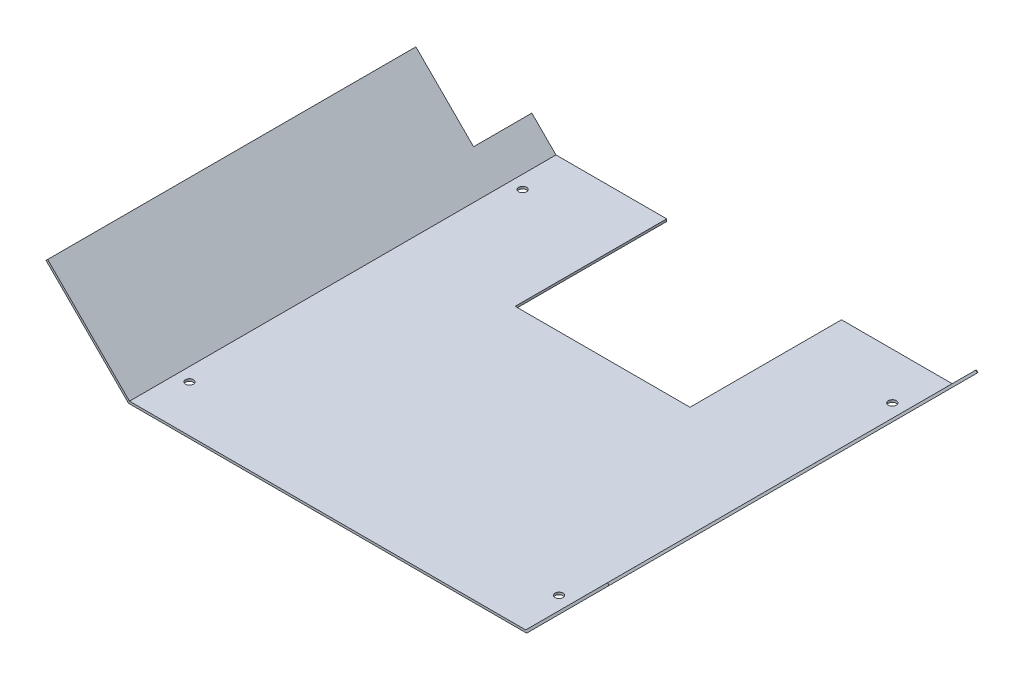
ISO-10303-21;
HEADER;
FILE_DESCRIPTION(('STEP AP214'),'2;1');
FILE_NAME('part.step','',(''),(''),'','','');
FILE_SCHEMA(('AUTOMOTIVE_DESIGN { 1 0 10303 214 1 1 1 1 }'));
ENDSEC;
DATA;
#1=APPLICATION_CONTEXT('core data for automotive mechanical design processes');
#2=APPLICATION_PROTOCOL_DEFINITION('international standard','automotive_design',2000,#1);
#3=PRODUCT_CONTEXT('',#1,'mechanical');
#4=PRODUCT('Part','Part','',(#3));
#5=PRODUCT_RELATED_PRODUCT_CATEGORY('part','',(#4));
#6=PRODUCT_DEFINITION_FORMATION('','',#4);
#7=PRODUCT_DEFINITION_CONTEXT('part definition',#1,'design');
#8=PRODUCT_DEFINITION('design','',#6,#7);
#9=PRODUCT_DEFINITION_SHAPE('','',#8);
#10=(LENGTH_UNIT() NAMED_UNIT(*) SI_UNIT(.MILLI.,.METRE.));
#11=(NAMED_UNIT(*) PLANE_ANGLE_UNIT() SI_UNIT($,.RADIAN.));
#12=(NAMED_UNIT(*) SI_UNIT($,.STERADIAN.) SOLID_ANGLE_UNIT());
#13=UNCERTAINTY_MEASURE_WITH_UNIT(LENGTH_MEASURE(1.E-05),#10,'distance_accuracy_value','');
#14=(GEOMETRIC_REPRESENTATION_CONTEXT(3) GLOBAL_UNCERTAINTY_ASSIGNED_CONTEXT((#13)) GLOBAL_UNIT_ASSIGNED_CONTEXT((#10,
#11,#12)) REPRESENTATION_CONTEXT('',''));
#15=CARTESIAN_POINT('',(0.,0.,0.));
#16=DIRECTION('',(0.,0.,1.));
#17=DIRECTION('',(1.,0.,0.));
#18=AXIS2_PLACEMENT_3D('',#15,#16,#17);
#19=CARTESIAN_POINT('',(181.763414842145,34.4059003953664,0.));
#20=DIRECTION('',(0.,0.,-1.));
#21=DIRECTION('',(-1.,0.,0.));
#22=AXIS2_PLACEMENT_3D('',#19,#20,#21);
#23=PLANE('',#22);
#24=DIRECTION('',(0.70709688415652,-0.707116678078053,0.));
#25=VECTOR('',#24,1.);
#26=CARTESIAN_POINT('',(35.8420481146136,130.83318444756,0.));
#27=LINE('',#26,#25);
#28=CARTESIAN_POINT('',(156.307234225257,10.3646261279663,0.));
#29=VERTEX_POINT('',#28);
#30=CARTESIAN_POINT('',(157.014331109414,9.65750944988825,0.));
#31=VERTEX_POINT('',#30);
#32=EDGE_CURVE('E158',#29,#31,#27,.T.);
#33=ORIENTED_EDGE('',*,*,#32,.T.);
#34=DIRECTION('',(0.707116678078054,0.70709688415652,0.));
#35=VECTOR('',#34,1.);
#36=CARTESIAN_POINT('',(146.649414842146,-0.707116678078054,0.));
#37=LINE('',#36,#35);
#38=CARTESIAN_POINT('',(146.356523321475,-1.,0.));
#39=VERTEX_POINT('',#38);
#40=EDGE_CURVE('E200',#39,#31,#37,.T.);
#41=ORIENTED_EDGE('',*,*,#40,.F.);
#42=DIRECTION('',(1.,0.,0.));
#43=VECTOR('',#42,1.);
#44=CARTESIAN_POINT('',(-24.057682042011,-1.,0.));
#45=LINE('',#44,#43);
#46=CARTESIAN_POINT('',(98.442317957989,-1.,0.));
#47=VERTEX_POINT('',#46);
#48=EDGE_CURVE('E188',#47,#39,#45,.T.);
#49=ORIENTED_EDGE('',*,*,#48,.F.);
#50=DIRECTION('',(0.,1.,0.));
#51=VECTOR('',#50,1.);
#52=CARTESIAN_POINT('',(98.442317957989,-1.,0.));
#53=LINE('',#52,#51);
#54=CARTESIAN_POINT('',(98.442317957989,0.,0.));
#55=VERTEX_POINT('',#54);
#56=EDGE_CURVE('E220',#47,#55,#53,.T.);
#57=ORIENTED_EDGE('',*,*,#56,.T.);
#58=DIRECTION('',(1.,0.,0.));
#59=VECTOR('',#58,1.);
#60=CARTESIAN_POINT('',(-24.057682042011,0.,0.));
#61=LINE('',#60,#59);
#62=CARTESIAN_POINT('',(145.942317957989,0.,0.));
#63=VERTEX_POINT('',#62);
#64=EDGE_CURVE('E196',#55,#63,#61,.T.);
#65=ORIENTED_EDGE('',*,*,#64,.T.);
#66=DIRECTION('',(0.707116678078054,0.70709688415652,0.));
#67=VECTOR('',#66,1.);
#68=CARTESIAN_POINT('',(145.942317957989,0.,0.));
#69=LINE('',#68,#67);
#70=EDGE_CURVE('E197',#63,#29,#69,.T.);
#71=ORIENTED_EDGE('',*,*,#70,.T.);
#72=EDGE_LOOP('',(#33,#41,#49,#57,#65,#71));
#73=FACE_BOUND('',#72,.T.);
#74=ADVANCED_FACE('F31',(#73),#23,.T.);
#75=CARTESIAN_POINT('',(146.649414842146,-0.707116678078054,183.));
#76=DIRECTION('',(-0.70709688415652,0.707116678078053,0.));
#77=DIRECTION('',(-0.707116678078054,-0.70709688415652,0.));
#78=AXIS2_PLACEMENT_3D('',#75,#76,#77);
#79=PLANE('',#78);
#80=ORIENTED_EDGE('',*,*,#40,.T.);
#81=DIRECTION('',(0.,0.,-1.));
#82=VECTOR('',#81,1.);
#83=CARTESIAN_POINT('',(157.014331109414,9.65750944988825,25.));
#84=LINE('',#83,#82);
#85=CARTESIAN_POINT('',(157.014331109414,9.65750944988825,25.));
#86=VERTEX_POINT('',#85);
#87=EDGE_CURVE('E290',#86,#31,#84,.T.);
#88=ORIENTED_EDGE('',*,*,#87,.F.);
#89=DIRECTION('',(-0.707116678078053,-0.70709688415652,0.));
#90=VECTOR('',#89,1.);
#91=CARTESIAN_POINT('',(157.014331109414,9.65750944988825,25.));
#92=LINE('',#91,#90);
#93=CARTESIAN_POINT('',(181.763414842145,34.4059003953664,25.));
#94=VERTEX_POINT('',#93);
#95=EDGE_CURVE('E286',#94,#86,#92,.T.);
#96=ORIENTED_EDGE('',*,*,#95,.F.);
#97=DIRECTION('',(0.,0.,-1.));
#98=VECTOR('',#97,1.);
#99=CARTESIAN_POINT('',(181.763414842145,34.4059003953664,183.));
#100=LINE('',#99,#98);
#101=CARTESIAN_POINT('',(181.763414842145,34.4059003953664,183.));
#102=VERTEX_POINT('',#101);
#103=EDGE_CURVE('E11',#102,#94,#100,.T.);
#104=ORIENTED_EDGE('',*,*,#103,.F.);
#105=DIRECTION('',(0.707116678078054,0.70709688415652,0.));
#106=VECTOR('',#105,1.);
#107=CARTESIAN_POINT('',(146.649414842146,-0.707116678078054,183.));
#108=LINE('',#107,#106);
#109=CARTESIAN_POINT('',(146.356523321475,-1.,183.));
#110=VERTEX_POINT('',#109);
#111=EDGE_CURVE('E187',#110,#102,#108,.T.);
#112=ORIENTED_EDGE('',*,*,#111,.F.);
#113=DIRECTION('',(0.,0.,-1.));
#114=VECTOR('',#113,1.);
#115=CARTESIAN_POINT('',(146.356523321475,-1.,183.));
#116=LINE('',#115,#114);
#117=EDGE_CURVE('E180',#110,#39,#116,.T.);
#118=ORIENTED_EDGE('',*,*,#117,.T.);
#119=EDGE_LOOP('',(#80,#88,#96,#104,#112,#118));
#120=FACE_BOUND('',#119,.T.);
#121=ADVANCED_FACE('F33',(#120),#79,.F.);
#122=CARTESIAN_POINT('',(181.056317957989,35.1130170734444,183.));
#123=DIRECTION('',(0.707116678078055,0.707096884156518,0.));
#124=DIRECTION('',(-0.707096884156518,0.707116678078055,0.));
#125=AXIS2_PLACEMENT_3D('',#122,#123,#124);
#126=PLANE('',#125);
#127=DIRECTION('',(0.70709688415652,-0.707116678078053,0.));
#128=VECTOR('',#127,1.);
#129=CARTESIAN_POINT('',(60.5911318473454,155.581575393038,25.));
#130=LINE('',#129,#128);
#131=CARTESIAN_POINT('',(181.056317957989,35.1130170734444,25.));
#132=VERTEX_POINT('',#131);
#133=EDGE_CURVE('E146',#132,#94,#130,.T.);
#134=ORIENTED_EDGE('',*,*,#133,.F.);
#135=DIRECTION('',(0.,0.,-1.));
#136=VECTOR('',#135,1.);
#137=CARTESIAN_POINT('',(181.056317957989,35.1130170734444,183.));
#138=LINE('',#137,#136);
#139=CARTESIAN_POINT('',(181.056317957989,35.1130170734444,183.));
#140=VERTEX_POINT('',#139);
#141=EDGE_CURVE('E39',#140,#132,#138,.T.);
#142=ORIENTED_EDGE('',*,*,#141,.F.);
#143=DIRECTION('',(0.707096884156518,-0.707116678078055,0.));
#144=VECTOR('',#143,1.);
#145=CARTESIAN_POINT('',(181.056317957989,35.1130170734444,183.));
#146=LINE('',#145,#144);
#147=EDGE_CURVE('E217',#140,#102,#146,.T.);
#148=ORIENTED_EDGE('',*,*,#147,.T.);
#149=ORIENTED_EDGE('',*,*,#103,.T.);
#150=EDGE_LOOP('',(#134,#142,#148,#149));
#151=FACE_BOUND('',#150,.T.);
#152=ADVANCED_FACE('F154',(#151),#126,.T.);
#153=CARTESIAN_POINT('',(145.942317957989,0.,183.));
#154=DIRECTION('',(-0.707096884156519,0.707116678078053,0.));
#155=DIRECTION('',(-0.707116678078054,-0.70709688415652,0.));
#156=AXIS2_PLACEMENT_3D('',#153,#154,#155);
#157=PLANE('',#156);
#158=DIRECTION('',(0.,0.,-1.));
#159=VECTOR('',#158,1.);
#160=CARTESIAN_POINT('',(156.307234225257,10.3646261279663,25.));
#161=LINE('',#160,#159);
#162=CARTESIAN_POINT('',(156.307234225257,10.3646261279663,25.));
#163=VERTEX_POINT('',#162);
#164=EDGE_CURVE('E151',#163,#29,#161,.T.);
#165=ORIENTED_EDGE('',*,*,#164,.T.);
#166=ORIENTED_EDGE('',*,*,#70,.F.);
#167=DIRECTION('',(0.,0.,-1.));
#168=VECTOR('',#167,1.);
#169=CARTESIAN_POINT('',(145.942317957989,0.,183.));
#170=LINE('',#169,#168);
#171=CARTESIAN_POINT('',(145.942317957989,0.,183.));
#172=VERTEX_POINT('',#171);
#173=EDGE_CURVE('E164',#172,#63,#170,.T.);
#174=ORIENTED_EDGE('',*,*,#173,.F.);
#175=DIRECTION('',(0.707116678078054,0.70709688415652,0.));
#176=VECTOR('',#175,1.);
#177=CARTESIAN_POINT('',(145.942317957989,0.,183.));
#178=LINE('',#177,#176);
#179=EDGE_CURVE('E163',#172,#140,#178,.T.);
#180=ORIENTED_EDGE('',*,*,#179,.T.);
#181=ORIENTED_EDGE('',*,*,#141,.T.);
#182=DIRECTION('',(-0.707116678078054,-0.70709688415652,0.));
#183=VECTOR('',#182,1.);
#184=CARTESIAN_POINT('',(156.307234225257,10.3646261279663,25.));
#185=LINE('',#184,#183);
#186=EDGE_CURVE('E143',#132,#163,#185,.T.);
#187=ORIENTED_EDGE('',*,*,#186,.T.);
#188=EDGE_LOOP('',(#165,#166,#174,#180,#181,#187));
#189=FACE_BOUND('',#188,.T.);
#190=ADVANCED_FACE('F161',(#189),#157,.T.);
#191=CARTESIAN_POINT('',(-24.057682042011,0.,183.));
#192=DIRECTION('',(0.,1.,0.));
#193=DIRECTION('',(0.,0.,1.));
#194=AXIS2_PLACEMENT_3D('',#191,#192,#193);
#195=PLANE('',#194);
#196=CARTESIAN_POINT('',(-18.357682042011,0.,20.));
#197=DIRECTION('',(0.,1.,0.));
#198=DIRECTION('',(0.,0.,1.));
#199=AXIS2_PLACEMENT_3D('',#196,#197,#198);
#200=CIRCLE('',#199,1.69999999999999);
#201=CARTESIAN_POINT('',(-18.357682042011,0.,21.7));
#202=VERTEX_POINT('',#201);
#203=EDGE_CURVE('E266',#202,#202,#200,.T.);
#204=ORIENTED_EDGE('',*,*,#203,.F.);
#205=EDGE_LOOP('',(#204));
#206=FACE_BOUND('',#205,.T.);
#207=CARTESIAN_POINT('',(140.242317957989,0.,20.));
#208=DIRECTION('',(0.,1.,0.));
#209=DIRECTION('',(0.,0.,1.));
#210=AXIS2_PLACEMENT_3D('',#207,#208,#209);
#211=CIRCLE('',#210,1.69999999999998);
#212=CARTESIAN_POINT('',(140.242317957989,0.,21.7));
#213=VERTEX_POINT('',#212);
#214=EDGE_CURVE('E260',#213,#213,#211,.T.);
#215=ORIENTED_EDGE('',*,*,#214,.F.);
#216=EDGE_LOOP('',(#215));
#217=FACE_BOUND('',#216,.T.);
#218=CARTESIAN_POINT('',(140.242317957989,0.,163.));
#219=DIRECTION('',(0.,1.,0.));
#220=DIRECTION('',(0.,0.,1.));
#221=AXIS2_PLACEMENT_3D('',#218,#219,#220);
#222=CIRCLE('',#221,1.69999999999998);
#223=CARTESIAN_POINT('',(140.242317957989,0.,164.7));
#224=VERTEX_POINT('',#223);
#225=EDGE_CURVE('E254',#224,#224,#222,.T.);
#226=ORIENTED_EDGE('',*,*,#225,.F.);
#227=EDGE_LOOP('',(#226));
#228=FACE_BOUND('',#227,.T.);
#229=CARTESIAN_POINT('',(-18.357682042011,0.,163.));
#230=DIRECTION('',(0.,1.,0.));
#231=DIRECTION('',(0.,0.,1.));
#232=AXIS2_PLACEMENT_3D('',#229,#230,#231);
#233=CIRCLE('',#232,1.69999999999999);
#234=CARTESIAN_POINT('',(-18.357682042011,0.,164.7));
#235=VERTEX_POINT('',#234);
#236=EDGE_CURVE('E248',#235,#235,#233,.T.);
#237=ORIENTED_EDGE('',*,*,#236,.F.);
#238=EDGE_LOOP('',(#237));
#239=FACE_BOUND('',#238,.T.);
#240=DIRECTION('',(0.,0.,-1.));
#241=VECTOR('',#240,1.);
#242=CARTESIAN_POINT('',(98.442317957989,0.,0.));
#243=LINE('',#242,#241);
#244=CARTESIAN_POINT('',(98.442317957989,0.,65.));
#245=VERTEX_POINT('',#244);
#246=EDGE_CURVE('E236',#245,#55,#243,.T.);
#247=ORIENTED_EDGE('',*,*,#246,.F.);
#248=DIRECTION('',(1.,0.,0.));
#249=VECTOR('',#248,1.);
#250=CARTESIAN_POINT('',(98.442317957989,0.,65.));
#251=LINE('',#250,#249);
#252=CARTESIAN_POINT('',(23.442317957989,0.,65.));
#253=VERTEX_POINT('',#252);
#254=EDGE_CURVE('E229',#253,#245,#251,.T.);
#255=ORIENTED_EDGE('',*,*,#254,.F.);
#256=DIRECTION('',(0.,0.,1.));
#257=VECTOR('',#256,1.);
#258=CARTESIAN_POINT('',(23.442317957989,0.,0.));
#259=LINE('',#258,#257);
#260=CARTESIAN_POINT('',(23.442317957989,0.,0.));
#261=VERTEX_POINT('',#260);
#262=EDGE_CURVE('E233',#261,#253,#259,.T.);
#263=ORIENTED_EDGE('',*,*,#262,.F.);
#264=CARTESIAN_POINT('',(-24.057682042011,0.,0.));
#265=VERTEX_POINT('',#264);
#266=EDGE_CURVE('E193',#265,#261,#61,.T.);
#267=ORIENTED_EDGE('',*,*,#266,.F.);
#268=DIRECTION('',(0.,0.,-1.));
#269=VECTOR('',#268,1.);
#270=CARTESIAN_POINT('',(-24.057682042011,0.,183.));
#271=LINE('',#270,#269);
#272=CARTESIAN_POINT('',(-24.057682042011,0.,183.));
#273=VERTEX_POINT('',#272);
#274=EDGE_CURVE('E166',#273,#265,#271,.T.);
#275=ORIENTED_EDGE('',*,*,#274,.F.);
#276=DIRECTION('',(1.,0.,0.));
#277=VECTOR('',#276,1.);
#278=CARTESIAN_POINT('',(-24.057682042011,0.,183.));
#279=LINE('',#278,#277);
#280=EDGE_CURVE('E213',#273,#172,#279,.T.);
#281=ORIENTED_EDGE('',*,*,#280,.T.);
#282=ORIENTED_EDGE('',*,*,#173,.T.);
#283=ORIENTED_EDGE('',*,*,#64,.F.);
#284=EDGE_LOOP('',(#247,#255,#263,#267,#275,#281,#282,#283));
#285=FACE_BOUND('',#284,.T.);
#286=ADVANCED_FACE('F300',(#206,#217,#228,#239,#285),#195,.T.);
#287=CARTESIAN_POINT('',(-59.1706991154554,35.114,183.));
#288=DIRECTION('',(0.707116678078054,0.707096884156519,0.));
#289=DIRECTION('',(-0.707096884156519,0.707116678078054,0.));
#290=AXIS2_PLACEMENT_3D('',#287,#288,#289);
#291=PLANE('',#290);
#292=DIRECTION('',(-0.707096884156519,0.707116678078054,0.));
#293=VECTOR('',#292,1.);
#294=CARTESIAN_POINT('',(-34.4223081699773,10.3649162672681,25.));
#295=LINE('',#294,#293);
#296=CARTESIAN_POINT('',(-34.4223081699773,10.3649162672681,25.));
#297=VERTEX_POINT('',#296);
#298=CARTESIAN_POINT('',(-59.1706991154554,35.114,25.));
#299=VERTEX_POINT('',#298);
#300=EDGE_CURVE('E282',#297,#299,#295,.T.);
#301=ORIENTED_EDGE('',*,*,#300,.T.);
#302=DIRECTION('',(0.,0.,-1.));
#303=VECTOR('',#302,1.);
#304=CARTESIAN_POINT('',(-59.1706991154554,35.114,183.));
#305=LINE('',#304,#303);
#306=CARTESIAN_POINT('',(-59.1706991154554,35.114,183.));
#307=VERTEX_POINT('',#306);
#308=EDGE_CURVE('E171',#307,#299,#305,.T.);
#309=ORIENTED_EDGE('',*,*,#308,.F.);
#310=DIRECTION('',(0.707096884156519,-0.707116678078054,0.));
#311=VECTOR('',#310,1.);
#312=CARTESIAN_POINT('',(-59.1706991154554,35.114,183.));
#313=LINE('',#312,#311);
#314=EDGE_CURVE('E210',#307,#273,#313,.T.);
#315=ORIENTED_EDGE('',*,*,#314,.T.);
#316=ORIENTED_EDGE('',*,*,#274,.T.);
#317=DIRECTION('',(0.707096884156519,-0.707116678078054,0.));
#318=VECTOR('',#317,1.);
#319=CARTESIAN_POINT('',(-59.1706991154554,35.114,0.));
#320=LINE('',#319,#318);
#321=CARTESIAN_POINT('',(-34.4223081699773,10.3649162672681,0.));
#322=VERTEX_POINT('',#321);
#323=EDGE_CURVE('E191',#322,#265,#320,.T.);
#324=ORIENTED_EDGE('',*,*,#323,.F.);
#325=DIRECTION('',(0.,0.,1.));
#326=VECTOR('',#325,1.);
#327=CARTESIAN_POINT('',(-34.4223081699773,10.3649162672681,0.));
#328=LINE('',#327,#326);
#329=EDGE_CURVE('E54',#322,#297,#328,.T.);
#330=ORIENTED_EDGE('',*,*,#329,.T.);
#331=EDGE_LOOP('',(#301,#309,#315,#316,#324,#330));
#332=FACE_BOUND('',#331,.T.);
#333=ADVANCED_FACE('F346',(#332),#291,.T.);
#334=CARTESIAN_POINT('',(-59.8778157935335,34.4069031158435,183.));
#335=DIRECTION('',(-0.707096884156518,0.707116678078055,0.));
#336=DIRECTION('',(-0.707116678078055,-0.707096884156518,0.));
#337=AXIS2_PLACEMENT_3D('',#334,#335,#336);
#338=PLANE('',#337);
#339=DIRECTION('',(-0.707116678078054,-0.707096884156519,0.));
#340=VECTOR('',#339,1.);
#341=CARTESIAN_POINT('',(61.300730091463,155.582056917605,25.));
#342=LINE('',#341,#340);
#343=CARTESIAN_POINT('',(-59.8778157935335,34.4069031158435,25.));
#344=VERTEX_POINT('',#343);
#345=EDGE_CURVE('E270',#299,#344,#342,.T.);
#346=ORIENTED_EDGE('',*,*,#345,.T.);
#347=DIRECTION('',(0.,0.,-1.));
#348=VECTOR('',#347,1.);
#349=CARTESIAN_POINT('',(-59.8778157935335,34.4069031158435,183.));
#350=LINE('',#349,#348);
#351=CARTESIAN_POINT('',(-59.8778157935335,34.4069031158435,183.));
#352=VERTEX_POINT('',#351);
#353=EDGE_CURVE('E174',#352,#344,#350,.T.);
#354=ORIENTED_EDGE('',*,*,#353,.F.);
#355=DIRECTION('',(0.707116678078055,0.707096884156518,0.));
#356=VECTOR('',#355,1.);
#357=CARTESIAN_POINT('',(-59.8778157935335,34.4069031158435,183.));
#358=LINE('',#357,#356);
#359=EDGE_CURVE('E207',#352,#307,#358,.T.);
#360=ORIENTED_EDGE('',*,*,#359,.T.);
#361=ORIENTED_EDGE('',*,*,#308,.T.);
#362=EDGE_LOOP('',(#346,#354,#360,#361));
#363=FACE_BOUND('',#362,.T.);
#364=ADVANCED_FACE('F361',(#363),#338,.T.);
#365=CARTESIAN_POINT('',(-59.8778157935335,34.4069031158435,183.));
#366=DIRECTION('',(0.707116678078054,0.707096884156519,0.));
#367=DIRECTION('',(-0.707096884156519,0.707116678078054,0.));
#368=AXIS2_PLACEMENT_3D('',#365,#366,#367);
#369=PLANE('',#368);
#370=ORIENTED_EDGE('',*,*,#353,.T.);
#371=DIRECTION('',(-0.707096884156519,0.707116678078054,0.));
#372=VECTOR('',#371,1.);
#373=CARTESIAN_POINT('',(-35.1294248480553,9.6578193831116,25.));
#374=LINE('',#373,#372);
#375=CARTESIAN_POINT('',(-35.1294248480553,9.6578193831116,25.));
#376=VERTEX_POINT('',#375);
#377=EDGE_CURVE('E274',#376,#344,#374,.T.);
#378=ORIENTED_EDGE('',*,*,#377,.F.);
#379=DIRECTION('',(0.,0.,1.));
#380=VECTOR('',#379,1.);
#381=CARTESIAN_POINT('',(-35.1294248480553,9.6578193831116,0.));
#382=LINE('',#381,#380);
#383=CARTESIAN_POINT('',(-35.1294248480553,9.6578193831116,0.));
#384=VERTEX_POINT('',#383);
#385=EDGE_CURVE('E279',#384,#376,#382,.T.);
#386=ORIENTED_EDGE('',*,*,#385,.F.);
#387=DIRECTION('',(0.707096884156519,-0.707116678078054,0.));
#388=VECTOR('',#387,1.);
#389=CARTESIAN_POINT('',(-59.8778157935335,34.4069031158435,0.));
#390=LINE('',#389,#388);
#391=CARTESIAN_POINT('',(-24.4719038033186,-1.,0.));
#392=VERTEX_POINT('',#391);
#393=EDGE_CURVE('E189',#384,#392,#390,.T.);
#394=ORIENTED_EDGE('',*,*,#393,.T.);
#395=DIRECTION('',(0.,0.,-1.));
#396=VECTOR('',#395,1.);
#397=CARTESIAN_POINT('',(-24.4719038033186,-1.,183.));
#398=LINE('',#397,#396);
#399=CARTESIAN_POINT('',(-24.4719038033186,-1.,183.));
#400=VERTEX_POINT('',#399);
#401=EDGE_CURVE('E177',#400,#392,#398,.T.);
#402=ORIENTED_EDGE('',*,*,#401,.F.);
#403=DIRECTION('',(0.707096884156519,-0.707116678078054,0.));
#404=VECTOR('',#403,1.);
#405=CARTESIAN_POINT('',(-59.8778157935335,34.4069031158435,183.));
#406=LINE('',#405,#404);
#407=EDGE_CURVE('E205',#352,#400,#406,.T.);
#408=ORIENTED_EDGE('',*,*,#407,.F.);
#409=EDGE_LOOP('',(#370,#378,#386,#394,#402,#408));
#410=FACE_BOUND('',#409,.T.);
#411=ADVANCED_FACE('F356',(#410),#369,.F.);
#412=CARTESIAN_POINT('',(-24.057682042011,-1.,183.));
#413=DIRECTION('',(0.,1.,0.));
#414=DIRECTION('',(0.,0.,1.));
#415=AXIS2_PLACEMENT_3D('',#412,#413,#414);
#416=PLANE('',#415);
#417=CARTESIAN_POINT('',(-18.357682042011,-1.,20.));
#418=DIRECTION('',(0.,1.,0.));
#419=DIRECTION('',(0.,0.,1.));
#420=AXIS2_PLACEMENT_3D('',#417,#418,#419);
#421=CIRCLE('',#420,1.7);
#422=CARTESIAN_POINT('',(-18.357682042011,-1.,21.7));
#423=VERTEX_POINT('',#422);
#424=EDGE_CURVE('E263',#423,#423,#421,.T.);
#425=ORIENTED_EDGE('',*,*,#424,.T.);
#426=EDGE_LOOP('',(#425));
#427=FACE_BOUND('',#426,.T.);
#428=CARTESIAN_POINT('',(140.242317957989,-1.,20.));
#429=DIRECTION('',(0.,1.,0.));
#430=DIRECTION('',(0.,0.,1.));
#431=AXIS2_PLACEMENT_3D('',#428,#429,#430);
#432=CIRCLE('',#431,1.70000000000001);
#433=CARTESIAN_POINT('',(140.242317957989,-1.,21.7));
#434=VERTEX_POINT('',#433);
#435=EDGE_CURVE('E257',#434,#434,#432,.T.);
#436=ORIENTED_EDGE('',*,*,#435,.T.);
#437=EDGE_LOOP('',(#436));
#438=FACE_BOUND('',#437,.T.);
#439=CARTESIAN_POINT('',(140.242317957989,-1.,163.));
#440=DIRECTION('',(0.,1.,0.));
#441=DIRECTION('',(0.,0.,1.));
#442=AXIS2_PLACEMENT_3D('',#439,#440,#441);
#443=CIRCLE('',#442,1.70000000000001);
#444=CARTESIAN_POINT('',(140.242317957989,-1.,164.7));
#445=VERTEX_POINT('',#444);
#446=EDGE_CURVE('E251',#445,#445,#443,.T.);
#447=ORIENTED_EDGE('',*,*,#446,.T.);
#448=EDGE_LOOP('',(#447));
#449=FACE_BOUND('',#448,.T.);
#450=CARTESIAN_POINT('',(-18.357682042011,-1.,163.));
#451=DIRECTION('',(0.,1.,0.));
#452=DIRECTION('',(0.,0.,1.));
#453=AXIS2_PLACEMENT_3D('',#450,#451,#452);
#454=CIRCLE('',#453,1.7);
#455=CARTESIAN_POINT('',(-18.357682042011,-1.,164.7));
#456=VERTEX_POINT('',#455);
#457=EDGE_CURVE('E238',#456,#456,#454,.T.);
#458=ORIENTED_EDGE('',*,*,#457,.T.);
#459=EDGE_LOOP('',(#458));
#460=FACE_BOUND('',#459,.T.);
#461=DIRECTION('',(1.,0.,0.));
#462=VECTOR('',#461,1.);
#463=CARTESIAN_POINT('',(98.442317957989,-1.,65.));
#464=LINE('',#463,#462);
#465=CARTESIAN_POINT('',(23.442317957989,-1.,65.));
#466=VERTEX_POINT('',#465);
#467=CARTESIAN_POINT('',(98.442317957989,-1.,65.));
#468=VERTEX_POINT('',#467);
#469=EDGE_CURVE('E224',#466,#468,#464,.T.);
#470=ORIENTED_EDGE('',*,*,#469,.T.);
#471=DIRECTION('',(0.,0.,-1.));
#472=VECTOR('',#471,1.);
#473=CARTESIAN_POINT('',(98.442317957989,-1.,0.));
#474=LINE('',#473,#472);
#475=EDGE_CURVE('E232',#468,#47,#474,.T.);
#476=ORIENTED_EDGE('',*,*,#475,.T.);
#477=ORIENTED_EDGE('',*,*,#48,.T.);
#478=ORIENTED_EDGE('',*,*,#117,.F.);
#479=DIRECTION('',(1.,0.,0.));
#480=VECTOR('',#479,1.);
#481=CARTESIAN_POINT('',(-24.057682042011,-1.,183.));
#482=LINE('',#481,#480);
#483=EDGE_CURVE('E183',#400,#110,#482,.T.);
#484=ORIENTED_EDGE('',*,*,#483,.F.);
#485=ORIENTED_EDGE('',*,*,#401,.T.);
#486=CARTESIAN_POINT('',(23.442317957989,-1.,0.));
#487=VERTEX_POINT('',#486);
#488=EDGE_CURVE('E184',#392,#487,#45,.T.);
#489=ORIENTED_EDGE('',*,*,#488,.T.);
#490=DIRECTION('',(0.,0.,1.));
#491=VECTOR('',#490,1.);
#492=CARTESIAN_POINT('',(23.442317957989,-1.,0.));
#493=LINE('',#492,#491);
#494=EDGE_CURVE('E241',#487,#466,#493,.T.);
#495=ORIENTED_EDGE('',*,*,#494,.T.);
#496=EDGE_LOOP('',(#470,#476,#477,#478,#484,#485,#489,#495));
#497=FACE_BOUND('',#496,.T.);
#498=ADVANCED_FACE('F340',(#427,#438,#449,#460,#497),#416,.F.);
#499=CARTESIAN_POINT('',(181.763414842145,34.4059003953664,183.));
#500=DIRECTION('',(0.,0.,-1.));
#501=DIRECTION('',(-1.,0.,0.));
#502=AXIS2_PLACEMENT_3D('',#499,#500,#501);
#503=PLANE('',#502);
#504=ORIENTED_EDGE('',*,*,#111,.T.);
#505=ORIENTED_EDGE('',*,*,#147,.F.);
#506=ORIENTED_EDGE('',*,*,#179,.F.);
#507=ORIENTED_EDGE('',*,*,#280,.F.);
#508=ORIENTED_EDGE('',*,*,#314,.F.);
#509=ORIENTED_EDGE('',*,*,#359,.F.);
#510=ORIENTED_EDGE('',*,*,#407,.T.);
#511=ORIENTED_EDGE('',*,*,#483,.T.);
#512=EDGE_LOOP('',(#504,#505,#506,#507,#508,#509,#510,#511));
#513=FACE_BOUND('',#512,.T.);
#514=ADVANCED_FACE('F303',(#513),#503,.F.);
#515=DIRECTION('',(-0.707116678078054,-0.707096884156519,0.));
#516=VECTOR('',#515,1.);
#517=CARTESIAN_POINT('',(86.0491210369411,130.832973184873,0.));
#518=LINE('',#517,#516);
#519=EDGE_CURVE('E271',#322,#384,#518,.T.);
#520=ORIENTED_EDGE('',*,*,#519,.F.);
#521=ORIENTED_EDGE('',*,*,#323,.T.);
#522=ORIENTED_EDGE('',*,*,#266,.T.);
#523=DIRECTION('',(0.,1.,0.));
#524=VECTOR('',#523,1.);
#525=CARTESIAN_POINT('',(23.442317957989,-1.,0.));
#526=LINE('',#525,#524);
#527=EDGE_CURVE('E223',#487,#261,#526,.T.);
#528=ORIENTED_EDGE('',*,*,#527,.F.);
#529=ORIENTED_EDGE('',*,*,#488,.F.);
#530=ORIENTED_EDGE('',*,*,#393,.F.);
#531=EDGE_LOOP('',(#520,#521,#522,#528,#529,#530));
#532=FACE_BOUND('',#531,.T.);
#533=ADVANCED_FACE('F324',(#532),#23,.T.);
#534=CARTESIAN_POINT('',(98.442317957989,-1.,0.));
#535=DIRECTION('',(1.,0.,0.));
#536=DIRECTION('',(0.,0.,-1.));
#537=AXIS2_PLACEMENT_3D('',#534,#535,#536);
#538=PLANE('',#537);
#539=ORIENTED_EDGE('',*,*,#246,.T.);
#540=ORIENTED_EDGE('',*,*,#56,.F.);
#541=ORIENTED_EDGE('',*,*,#475,.F.);
#542=DIRECTION('',(0.,1.,0.));
#543=VECTOR('',#542,1.);
#544=CARTESIAN_POINT('',(98.442317957989,-1.,65.));
#545=LINE('',#544,#543);
#546=EDGE_CURVE('E203',#468,#245,#545,.T.);
#547=ORIENTED_EDGE('',*,*,#546,.T.);
#548=EDGE_LOOP('',(#539,#540,#541,#547));
#549=FACE_BOUND('',#548,.T.);
#550=ADVANCED_FACE('F331',(#549),#538,.F.);
#551=CARTESIAN_POINT('',(98.442317957989,-1.,65.));
#552=DIRECTION('',(0.,0.,1.));
#553=DIRECTION('',(1.,0.,0.));
#554=AXIS2_PLACEMENT_3D('',#551,#552,#553);
#555=PLANE('',#554);
#556=ORIENTED_EDGE('',*,*,#254,.T.);
#557=ORIENTED_EDGE('',*,*,#546,.F.);
#558=ORIENTED_EDGE('',*,*,#469,.F.);
#559=DIRECTION('',(0.,1.,0.));
#560=VECTOR('',#559,1.);
#561=CARTESIAN_POINT('',(23.442317957989,-1.,65.));
#562=LINE('',#561,#560);
#563=EDGE_CURVE('E226',#466,#253,#562,.T.);
#564=ORIENTED_EDGE('',*,*,#563,.T.);
#565=EDGE_LOOP('',(#556,#557,#558,#564));
#566=FACE_BOUND('',#565,.T.);
#567=ADVANCED_FACE('F337',(#566),#555,.F.);
#568=CARTESIAN_POINT('',(23.442317957989,-1.,0.));
#569=DIRECTION('',(-1.,0.,0.));
#570=DIRECTION('',(0.,0.,1.));
#571=AXIS2_PLACEMENT_3D('',#568,#569,#570);
#572=PLANE('',#571);
#573=ORIENTED_EDGE('',*,*,#262,.T.);
#574=ORIENTED_EDGE('',*,*,#563,.F.);
#575=ORIENTED_EDGE('',*,*,#494,.F.);
#576=ORIENTED_EDGE('',*,*,#527,.T.);
#577=EDGE_LOOP('',(#573,#574,#575,#576));
#578=FACE_BOUND('',#577,.T.);
#579=ADVANCED_FACE('F461',(#578),#572,.F.);
#580=CARTESIAN_POINT('',(-18.357682042011,0.,163.));
#581=DIRECTION('',(0.,1.,0.));
#582=DIRECTION('',(0.,0.,1.));
#583=AXIS2_PLACEMENT_3D('',#580,#581,#582);
#584=CYLINDRICAL_SURFACE('',#583,1.69999999999999);
#585=ORIENTED_EDGE('',*,*,#457,.F.);
#586=EDGE_LOOP('',(#585));
#587=FACE_BOUND('',#586,.T.);
#588=ORIENTED_EDGE('',*,*,#236,.T.);
#589=EDGE_LOOP('',(#588));
#590=FACE_BOUND('',#589,.T.);
#591=ADVANCED_FACE('F469',(#587,#590),#584,.F.);
#592=CARTESIAN_POINT('',(140.242317957989,0.,163.));
#593=DIRECTION('',(0.,1.,0.));
#594=DIRECTION('',(0.,0.,1.));
#595=AXIS2_PLACEMENT_3D('',#592,#593,#594);
#596=CYLINDRICAL_SURFACE('',#595,1.69999999999999);
#597=ORIENTED_EDGE('',*,*,#446,.F.);
#598=EDGE_LOOP('',(#597));
#599=FACE_BOUND('',#598,.T.);
#600=ORIENTED_EDGE('',*,*,#225,.T.);
#601=EDGE_LOOP('',(#600));
#602=FACE_BOUND('',#601,.T.);
#603=ADVANCED_FACE('F477',(#599,#602),#596,.F.);
#604=CARTESIAN_POINT('',(140.242317957989,0.,20.));
#605=DIRECTION('',(0.,1.,0.));
#606=DIRECTION('',(0.,0.,1.));
#607=AXIS2_PLACEMENT_3D('',#604,#605,#606);
#608=CYLINDRICAL_SURFACE('',#607,1.69999999999999);
#609=ORIENTED_EDGE('',*,*,#435,.F.);
#610=EDGE_LOOP('',(#609));
#611=FACE_BOUND('',#610,.T.);
#612=ORIENTED_EDGE('',*,*,#214,.T.);
#613=EDGE_LOOP('',(#612));
#614=FACE_BOUND('',#613,.T.);
#615=ADVANCED_FACE('F486',(#611,#614),#608,.F.);
#616=CARTESIAN_POINT('',(-18.357682042011,0.,20.));
#617=DIRECTION('',(0.,1.,0.));
#618=DIRECTION('',(0.,0.,1.));
#619=AXIS2_PLACEMENT_3D('',#616,#617,#618);
#620=CYLINDRICAL_SURFACE('',#619,1.69999999999999);
#621=ORIENTED_EDGE('',*,*,#424,.F.);
#622=EDGE_LOOP('',(#621));
#623=FACE_BOUND('',#622,.T.);
#624=ORIENTED_EDGE('',*,*,#203,.T.);
#625=EDGE_LOOP('',(#624));
#626=FACE_BOUND('',#625,.T.);
#627=ADVANCED_FACE('F400',(#623,#626),#620,.F.);
#628=CARTESIAN_POINT('',(86.0491210369411,130.832973184873,25.));
#629=DIRECTION('',(0.,0.,1.));
#630=DIRECTION('',(1.,0.,0.));
#631=AXIS2_PLACEMENT_3D('',#628,#629,#630);
#632=PLANE('',#631);
#633=DIRECTION('',(-0.707116678078054,-0.707096884156519,0.));
#634=VECTOR('',#633,1.);
#635=CARTESIAN_POINT('',(86.0491210369411,130.832973184873,25.));
#636=LINE('',#635,#634);
#637=EDGE_CURVE('E273',#297,#376,#636,.T.);
#638=ORIENTED_EDGE('',*,*,#637,.T.);
#639=ORIENTED_EDGE('',*,*,#377,.T.);
#640=ORIENTED_EDGE('',*,*,#345,.F.);
#641=ORIENTED_EDGE('',*,*,#300,.F.);
#642=EDGE_LOOP('',(#638,#639,#640,#641));
#643=FACE_BOUND('',#642,.T.);
#644=ADVANCED_FACE('F319',(#643),#632,.F.);
#645=CARTESIAN_POINT('',(86.0491210369411,130.832973184873,0.));
#646=DIRECTION('',(0.707096884156519,-0.707116678078054,0.));
#647=DIRECTION('',(0.707116678078054,0.707096884156519,0.));
#648=AXIS2_PLACEMENT_3D('',#645,#646,#647);
#649=PLANE('',#648);
#650=ORIENTED_EDGE('',*,*,#519,.T.);
#651=ORIENTED_EDGE('',*,*,#385,.T.);
#652=ORIENTED_EDGE('',*,*,#637,.F.);
#653=ORIENTED_EDGE('',*,*,#329,.F.);
#654=EDGE_LOOP('',(#650,#651,#652,#653));
#655=FACE_BOUND('',#654,.T.);
#656=ADVANCED_FACE('F312',(#655),#649,.F.);
#657=CARTESIAN_POINT('',(35.8420481146136,130.83318444756,25.));
#658=DIRECTION('',(-0.707116678078053,-0.70709688415652,0.));
#659=DIRECTION('',(0.70709688415652,-0.707116678078053,0.));
#660=AXIS2_PLACEMENT_3D('',#657,#658,#659);
#661=PLANE('',#660);
#662=DIRECTION('',(0.70709688415652,-0.707116678078053,0.));
#663=VECTOR('',#662,1.);
#664=CARTESIAN_POINT('',(35.8420481146136,130.83318444756,25.));
#665=LINE('',#664,#663);
#666=EDGE_CURVE('E46',#163,#86,#665,.T.);
#667=ORIENTED_EDGE('',*,*,#666,.T.);
#668=ORIENTED_EDGE('',*,*,#87,.T.);
#669=ORIENTED_EDGE('',*,*,#32,.F.);
#670=ORIENTED_EDGE('',*,*,#164,.F.);
#671=EDGE_LOOP('',(#667,#668,#669,#670));
#672=FACE_BOUND('',#671,.T.);
#673=ADVANCED_FACE('F310',(#672),#661,.F.);
#674=CARTESIAN_POINT('',(35.8420481146136,130.83318444756,25.));
#675=DIRECTION('',(0.,0.,1.));
#676=DIRECTION('',(1.,0.,0.));
#677=AXIS2_PLACEMENT_3D('',#674,#675,#676);
#678=PLANE('',#677);
#679=ORIENTED_EDGE('',*,*,#133,.T.);
#680=ORIENTED_EDGE('',*,*,#95,.T.);
#681=ORIENTED_EDGE('',*,*,#666,.F.);
#682=ORIENTED_EDGE('',*,*,#186,.F.);
#683=EDGE_LOOP('',(#679,#680,#681,#682));
#684=FACE_BOUND('',#683,.T.);
#685=ADVANCED_FACE('F145',(#684),#678,.F.);
#686=CLOSED_SHELL('',(#74,#121,#152,#190,#286,#333,#364,#411,#498,#514,#533,#550,#567,#579,#591,
#603,#615,#627,#644,#656,#673,#685));
#687=MANIFOLD_SOLID_BREP('B2',#686);
#688=ADVANCED_BREP_SHAPE_REPRESENTATION('',(#18,#687),#14);
#689=SHAPE_DEFINITION_REPRESENTATION(#9,#688);
ENDSEC;
END-ISO-10303-21;
